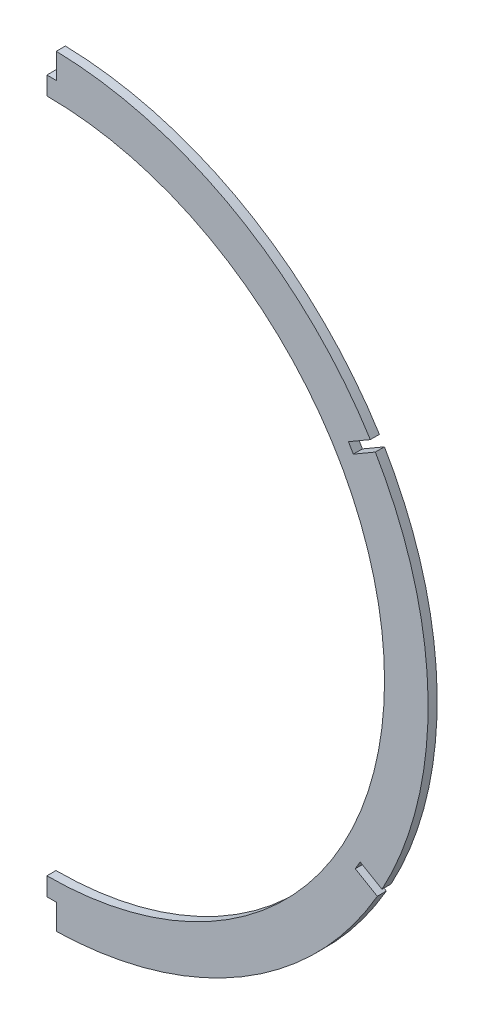
ISO-10303-21;
HEADER;
FILE_DESCRIPTION(('STEP AP214'),'2;1');
FILE_NAME('part.step','',(''),(''),'','','');
FILE_SCHEMA(('AUTOMOTIVE_DESIGN { 1 0 10303 214 1 1 1 1 }'));
ENDSEC;
DATA;
#1=APPLICATION_CONTEXT('core data for automotive mechanical design processes');
#2=APPLICATION_PROTOCOL_DEFINITION('international standard','automotive_design',2000,#1);
#3=PRODUCT_CONTEXT('',#1,'mechanical');
#4=PRODUCT('Part','Part','',(#3));
#5=PRODUCT_RELATED_PRODUCT_CATEGORY('part','',(#4));
#6=PRODUCT_DEFINITION_FORMATION('','',#4);
#7=PRODUCT_DEFINITION_CONTEXT('part definition',#1,'design');
#8=PRODUCT_DEFINITION('design','',#6,#7);
#9=PRODUCT_DEFINITION_SHAPE('','',#8);
#10=(LENGTH_UNIT() NAMED_UNIT(*) SI_UNIT(.MILLI.,.METRE.));
#11=(NAMED_UNIT(*) PLANE_ANGLE_UNIT() SI_UNIT($,.RADIAN.));
#12=(NAMED_UNIT(*) SI_UNIT($,.STERADIAN.) SOLID_ANGLE_UNIT());
#13=UNCERTAINTY_MEASURE_WITH_UNIT(LENGTH_MEASURE(1.E-05),#10,'distance_accuracy_value','');
#14=(GEOMETRIC_REPRESENTATION_CONTEXT(3) GLOBAL_UNCERTAINTY_ASSIGNED_CONTEXT((#13)) GLOBAL_UNIT_ASSIGNED_CONTEXT((#10,
#11,#12)) REPRESENTATION_CONTEXT('',''));
#15=CARTESIAN_POINT('',(0.,0.,0.));
#16=DIRECTION('',(0.,0.,1.));
#17=DIRECTION('',(1.,0.,0.));
#18=AXIS2_PLACEMENT_3D('',#15,#16,#17);
#19=CARTESIAN_POINT('',(0.,23.495,1.5875));
#20=DIRECTION('',(0.,0.,-1.));
#21=DIRECTION('',(-1.,0.,0.));
#22=AXIS2_PLACEMENT_3D('',#19,#20,#21);
#23=CYLINDRICAL_SURFACE('',#22,133.35);
#24=DIRECTION('',(0.,0.,-1.));
#25=VECTOR('',#24,1.);
#26=CARTESIAN_POINT('',(3.302,156.804111826611,1.58750000000002));
#27=LINE('',#26,#25);
#28=CARTESIAN_POINT('',(3.302,156.804111826611,1.58750000000002));
#29=VERTEX_POINT('',#28);
#30=CARTESIAN_POINT('',(3.302,156.804111826611,-1.5875));
#31=VERTEX_POINT('',#30);
#32=EDGE_CURVE('E179',#29,#31,#27,.T.);
#33=ORIENTED_EDGE('',*,*,#32,.F.);
#34=CARTESIAN_POINT('',(0.,23.495,1.5875));
#35=DIRECTION('',(0.,0.,1.));
#36=DIRECTION('',(1.,0.,0.));
#37=AXIS2_PLACEMENT_3D('',#34,#35,#36);
#38=CIRCLE('',#37,133.35);
#39=CARTESIAN_POINT('',(113.138876948253,94.0769879493919,1.58750000000002));
#40=VERTEX_POINT('',#39);
#41=EDGE_CURVE('E172',#40,#29,#38,.T.);
#42=ORIENTED_EDGE('',*,*,#41,.F.);
#43=DIRECTION('',(0.,0.,-1.));
#44=VECTOR('',#43,1.);
#45=CARTESIAN_POINT('',(113.138876948253,94.0769879493919,1.58750000000002));
#46=LINE('',#45,#44);
#47=CARTESIAN_POINT('',(113.138876948253,94.0769879493919,-1.5875));
#48=VERTEX_POINT('',#47);
#49=EDGE_CURVE('E200',#40,#48,#46,.T.);
#50=ORIENTED_EDGE('',*,*,#49,.T.);
#51=CARTESIAN_POINT('',(0.,23.495,-1.5875));
#52=DIRECTION('',(0.,0.,1.));
#53=DIRECTION('',(1.,0.,0.));
#54=AXIS2_PLACEMENT_3D('',#51,#52,#53);
#55=CIRCLE('',#54,133.35);
#56=EDGE_CURVE('E251',#48,#31,#55,.T.);
#57=ORIENTED_EDGE('',*,*,#56,.T.);
#58=EDGE_LOOP('',(#33,#42,#50,#57));
#59=FACE_BOUND('',#58,.T.);
#60=ADVANCED_FACE('F36',(#59),#23,.T.);
#61=DIRECTION('',(0.,0.,-1.));
#62=VECTOR('',#61,1.);
#63=CARTESIAN_POINT('',(114.89077453908,91.1879274430517,1.58750000000002));
#64=LINE('',#63,#62);
#65=CARTESIAN_POINT('',(114.89077453908,91.1879274430517,1.58750000000002));
#66=VERTEX_POINT('',#65);
#67=CARTESIAN_POINT('',(114.89077453908,91.1879274430517,-1.5875));
#68=VERTEX_POINT('',#67);
#69=EDGE_CURVE('E198',#66,#68,#64,.T.);
#70=ORIENTED_EDGE('',*,*,#69,.F.);
#71=CARTESIAN_POINT('',(117.216023462274,-40.0866509984727,1.58750000000002));
#72=VERTEX_POINT('',#71);
#73=EDGE_CURVE('E256',#72,#66,#38,.T.);
#74=ORIENTED_EDGE('',*,*,#73,.F.);
#75=DIRECTION('',(0.,0.,-1.));
#76=VECTOR('',#75,1.);
#77=CARTESIAN_POINT('',(117.216023462274,-40.0866509984727,1.58750000000002));
#78=LINE('',#77,#76);
#79=CARTESIAN_POINT('',(117.216023462274,-40.0866509984727,-1.5875));
#80=VERTEX_POINT('',#79);
#81=EDGE_CURVE('E221',#72,#80,#78,.T.);
#82=ORIENTED_EDGE('',*,*,#81,.T.);
#83=EDGE_CURVE('E260',#80,#68,#55,.T.);
#84=ORIENTED_EDGE('',*,*,#83,.T.);
#85=EDGE_LOOP('',(#70,#74,#82,#84));
#86=FACE_BOUND('',#85,.T.);
#87=ADVANCED_FACE('F275',(#86),#23,.T.);
#88=DIRECTION('',(0.,0.,-1.));
#89=VECTOR('',#88,1.);
#90=CARTESIAN_POINT('',(115.567539805184,-43.035941999774,1.58750000000002));
#91=LINE('',#90,#89);
#92=CARTESIAN_POINT('',(115.567539805184,-43.035941999774,1.58750000000002));
#93=VERTEX_POINT('',#92);
#94=CARTESIAN_POINT('',(115.567539805184,-43.035941999774,-1.5875));
#95=VERTEX_POINT('',#94);
#96=EDGE_CURVE('E193',#93,#95,#91,.T.);
#97=ORIENTED_EDGE('',*,*,#96,.F.);
#98=CARTESIAN_POINT('',(3.302,-109.814111826611,1.58750000000002));
#99=VERTEX_POINT('',#98);
#100=EDGE_CURVE('E258',#99,#93,#38,.T.);
#101=ORIENTED_EDGE('',*,*,#100,.F.);
#102=DIRECTION('',(0.,0.,-1.));
#103=VECTOR('',#102,1.);
#104=CARTESIAN_POINT('',(3.302,-109.814111826611,1.58750000000002));
#105=LINE('',#104,#103);
#106=CARTESIAN_POINT('',(3.302,-109.814111826611,-1.5875));
#107=VERTEX_POINT('',#106);
#108=EDGE_CURVE('E239',#99,#107,#105,.T.);
#109=ORIENTED_EDGE('',*,*,#108,.T.);
#110=EDGE_CURVE('E257',#107,#95,#55,.T.);
#111=ORIENTED_EDGE('',*,*,#110,.T.);
#112=EDGE_LOOP('',(#97,#101,#109,#111));
#113=FACE_BOUND('',#112,.T.);
#114=ADVANCED_FACE('F312',(#113),#23,.T.);
#115=CARTESIAN_POINT('',(0.,23.495,1.5875));
#116=DIRECTION('',(0.,0.,1.));
#117=DIRECTION('',(1.,0.,0.));
#118=AXIS2_PLACEMENT_3D('',#115,#116,#117);
#119=PLANE('',#118);
#120=ORIENTED_EDGE('',*,*,#41,.T.);
#121=DIRECTION('',(0.,1.,0.));
#122=VECTOR('',#121,1.);
#123=CARTESIAN_POINT('',(3.302,0.,1.58750000000002));
#124=LINE('',#123,#122);
#125=CARTESIAN_POINT('',(3.302,147.955,1.58750000000002));
#126=VERTEX_POINT('',#125);
#127=EDGE_CURVE('E152',#126,#29,#124,.T.);
#128=ORIENTED_EDGE('',*,*,#127,.F.);
#129=DIRECTION('',(-1.,0.,0.));
#130=VECTOR('',#129,1.);
#131=CARTESIAN_POINT('',(0.,147.955,1.58750000000002));
#132=LINE('',#131,#130);
#133=CARTESIAN_POINT('',(0.,147.955,1.58750000000002));
#134=VERTEX_POINT('',#133);
#135=EDGE_CURVE('E159',#126,#134,#132,.T.);
#136=ORIENTED_EDGE('',*,*,#135,.T.);
#137=DIRECTION('',(0.,1.,0.));
#138=VECTOR('',#137,1.);
#139=CARTESIAN_POINT('',(0.,23.495,1.5875));
#140=LINE('',#139,#138);
#141=CARTESIAN_POINT('',(0.,141.605,1.58750000000002));
#142=VERTEX_POINT('',#141);
#143=EDGE_CURVE('E247',#142,#134,#140,.T.);
#144=ORIENTED_EDGE('',*,*,#143,.F.);
#145=CARTESIAN_POINT('',(0.,23.495,1.5875));
#146=DIRECTION('',(0.,0.,1.));
#147=DIRECTION('',(1.,0.,0.));
#148=AXIS2_PLACEMENT_3D('',#145,#146,#147);
#149=CIRCLE('',#148,118.11);
#150=CARTESIAN_POINT('',(0.,-94.615,1.5875));
#151=VERTEX_POINT('',#150);
#152=EDGE_CURVE('E252',#151,#142,#149,.T.);
#153=ORIENTED_EDGE('',*,*,#152,.F.);
#154=CARTESIAN_POINT('',(0.,-100.965,1.5875));
#155=VERTEX_POINT('',#154);
#156=EDGE_CURVE('E244',#155,#151,#140,.T.);
#157=ORIENTED_EDGE('',*,*,#156,.F.);
#158=DIRECTION('',(-1.,0.,0.));
#159=VECTOR('',#158,1.);
#160=CARTESIAN_POINT('',(0.,-100.965,1.58750000000002));
#161=LINE('',#160,#159);
#162=CARTESIAN_POINT('',(3.302,-100.965,1.58750000000002));
#163=VERTEX_POINT('',#162);
#164=EDGE_CURVE('E227',#163,#155,#161,.T.);
#165=ORIENTED_EDGE('',*,*,#164,.F.);
#166=DIRECTION('',(0.,-1.,0.));
#167=VECTOR('',#166,1.);
#168=CARTESIAN_POINT('',(3.302,0.,1.58750000000002));
#169=LINE('',#168,#167);
#170=EDGE_CURVE('E229',#163,#99,#169,.T.);
#171=ORIENTED_EDGE('',*,*,#170,.T.);
#172=ORIENTED_EDGE('',*,*,#100,.T.);
#173=DIRECTION('',(0.864121649398804,-0.503282996971178,0.));
#174=VECTOR('',#173,1.);
#175=CARTESIAN_POINT('',(10.5563047964807,18.1248553342521,1.58750000000002));
#176=LINE('',#175,#174);
#177=CARTESIAN_POINT('',(107.866561664445,-38.5507270292004,1.58750000000002));
#178=VERTEX_POINT('',#177);
#179=EDGE_CURVE('E204',#178,#93,#176,.T.);
#180=ORIENTED_EDGE('',*,*,#179,.F.);
#181=DIRECTION('',(0.503282996971166,0.864121649398811,0.));
#182=VECTOR('',#181,1.);
#183=CARTESIAN_POINT('',(97.3102568679656,-56.6755823634513,1.58750000000002));
#184=LINE('',#183,#182);
#185=CARTESIAN_POINT('',(109.566752284813,-35.6315512732013,1.58750000000002));
#186=VERTEX_POINT('',#185);
#187=EDGE_CURVE('E206',#178,#186,#184,.T.);
#188=ORIENTED_EDGE('',*,*,#187,.T.);
#189=DIRECTION('',(0.86412164939881,-0.503282996971168,0.));
#190=VECTOR('',#189,1.);
#191=CARTESIAN_POINT('',(12.2564954168479,21.0440310902502,1.58750000000002));
#192=LINE('',#191,#190);
#193=EDGE_CURVE('E210',#186,#72,#192,.T.);
#194=ORIENTED_EDGE('',*,*,#193,.T.);
#195=ORIENTED_EDGE('',*,*,#73,.T.);
#196=DIRECTION('',(0.864121648134546,0.503282999141871,0.));
#197=VECTOR('',#196,1.);
#198=CARTESIAN_POINT('',(-10.5563048253218,18.1248552790799,1.58750000000002));
#199=LINE('',#198,#197);
#200=CARTESIAN_POINT('',(107.189796409653,86.7027124531591,1.58750000000002));
#201=VERTEX_POINT('',#200);
#202=EDGE_CURVE('E188',#201,#66,#199,.T.);
#203=ORIENTED_EDGE('',*,*,#202,.F.);
#204=DIRECTION('',(0.503282999141861,-0.864121648134551,0.));
#205=VECTOR('',#204,1.);
#206=CARTESIAN_POINT('',(117.746101234976,68.5778571740777,1.58750000000002));
#207=LINE('',#206,#205);
#208=CARTESIAN_POINT('',(105.489605781952,89.6218882048873,1.58750000000002));
#209=VERTEX_POINT('',#208);
#210=EDGE_CURVE('E183',#209,#201,#207,.T.);
#211=ORIENTED_EDGE('',*,*,#210,.F.);
#212=DIRECTION('',(0.864121648134546,0.503282999141871,0.));
#213=VECTOR('',#212,1.);
#214=CARTESIAN_POINT('',(-12.2564954530229,21.0440310308081,1.58750000000002));
#215=LINE('',#214,#213);
#216=EDGE_CURVE('E185',#209,#40,#215,.T.);
#217=ORIENTED_EDGE('',*,*,#216,.T.);
#218=EDGE_LOOP('',(#120,#128,#136,#144,#153,#157,#165,#171,#172,#180,#188,#194,#195,#203,#211,#217));
#219=FACE_BOUND('',#218,.T.);
#220=ADVANCED_FACE('F169',(#219),#119,.T.);
#221=CARTESIAN_POINT('',(0.,23.495,-1.5875));
#222=DIRECTION('',(0.,0.,1.));
#223=DIRECTION('',(1.,0.,0.));
#224=AXIS2_PLACEMENT_3D('',#221,#222,#223);
#225=PLANE('',#224);
#226=DIRECTION('',(0.,1.,0.));
#227=VECTOR('',#226,1.);
#228=CARTESIAN_POINT('',(3.302,0.,-1.5875));
#229=LINE('',#228,#227);
#230=CARTESIAN_POINT('',(3.302,147.955,-1.5875));
#231=VERTEX_POINT('',#230);
#232=EDGE_CURVE('E155',#231,#31,#229,.T.);
#233=ORIENTED_EDGE('',*,*,#232,.T.);
#234=ORIENTED_EDGE('',*,*,#56,.F.);
#235=DIRECTION('',(0.864121648134546,0.503282999141871,0.));
#236=VECTOR('',#235,1.);
#237=CARTESIAN_POINT('',(-12.2564954530229,21.0440310308081,-1.5875));
#238=LINE('',#237,#236);
#239=CARTESIAN_POINT('',(105.489605781952,89.6218882048873,-1.5875));
#240=VERTEX_POINT('',#239);
#241=EDGE_CURVE('E192',#240,#48,#238,.T.);
#242=ORIENTED_EDGE('',*,*,#241,.F.);
#243=DIRECTION('',(0.503282999141861,-0.864121648134551,0.));
#244=VECTOR('',#243,1.);
#245=CARTESIAN_POINT('',(117.746101234976,68.5778571740777,-1.5875));
#246=LINE('',#245,#244);
#247=CARTESIAN_POINT('',(107.189796409653,86.7027124531591,-1.5875));
#248=VERTEX_POINT('',#247);
#249=EDGE_CURVE('E50',#240,#248,#246,.T.);
#250=ORIENTED_EDGE('',*,*,#249,.T.);
#251=DIRECTION('',(0.864121648134546,0.503282999141871,0.));
#252=VECTOR('',#251,1.);
#253=CARTESIAN_POINT('',(-10.5563048253218,18.1248552790799,-1.5875));
#254=LINE('',#253,#252);
#255=EDGE_CURVE('E186',#248,#68,#254,.T.);
#256=ORIENTED_EDGE('',*,*,#255,.T.);
#257=ORIENTED_EDGE('',*,*,#83,.F.);
#258=DIRECTION('',(0.86412164939881,-0.503282996971168,0.));
#259=VECTOR('',#258,1.);
#260=CARTESIAN_POINT('',(12.2564954168479,21.0440310902502,-1.5875));
#261=LINE('',#260,#259);
#262=CARTESIAN_POINT('',(109.566752284813,-35.6315512732013,-1.5875));
#263=VERTEX_POINT('',#262);
#264=EDGE_CURVE('E207',#263,#80,#261,.T.);
#265=ORIENTED_EDGE('',*,*,#264,.F.);
#266=DIRECTION('',(0.503282996971166,0.864121649398811,0.));
#267=VECTOR('',#266,1.);
#268=CARTESIAN_POINT('',(97.3102568679656,-56.6755823634513,-1.5875));
#269=LINE('',#268,#267);
#270=CARTESIAN_POINT('',(107.866561664445,-38.5507270292004,-1.5875));
#271=VERTEX_POINT('',#270);
#272=EDGE_CURVE('E215',#271,#263,#269,.T.);
#273=ORIENTED_EDGE('',*,*,#272,.F.);
#274=DIRECTION('',(0.864121649398804,-0.503282996971178,0.));
#275=VECTOR('',#274,1.);
#276=CARTESIAN_POINT('',(10.5563047964807,18.1248553342521,-1.5875));
#277=LINE('',#276,#275);
#278=EDGE_CURVE('E58',#271,#95,#277,.T.);
#279=ORIENTED_EDGE('',*,*,#278,.T.);
#280=ORIENTED_EDGE('',*,*,#110,.F.);
#281=DIRECTION('',(0.,-1.,0.));
#282=VECTOR('',#281,1.);
#283=CARTESIAN_POINT('',(3.302,0.,-1.5875));
#284=LINE('',#283,#282);
#285=CARTESIAN_POINT('',(3.302,-100.965,-1.5875));
#286=VERTEX_POINT('',#285);
#287=EDGE_CURVE('E230',#286,#107,#284,.T.);
#288=ORIENTED_EDGE('',*,*,#287,.F.);
#289=DIRECTION('',(-1.,0.,0.));
#290=VECTOR('',#289,1.);
#291=CARTESIAN_POINT('',(0.,-100.965,-1.5875));
#292=LINE('',#291,#290);
#293=CARTESIAN_POINT('',(0.,-100.965,-1.5875));
#294=VERTEX_POINT('',#293);
#295=EDGE_CURVE('E234',#286,#294,#292,.T.);
#296=ORIENTED_EDGE('',*,*,#295,.T.);
#297=DIRECTION('',(0.,1.,0.));
#298=VECTOR('',#297,1.);
#299=CARTESIAN_POINT('',(0.,23.495,-1.5875));
#300=LINE('',#299,#298);
#301=CARTESIAN_POINT('',(0.,-94.615,-1.58750000000002));
#302=VERTEX_POINT('',#301);
#303=EDGE_CURVE('E181',#294,#302,#300,.T.);
#304=ORIENTED_EDGE('',*,*,#303,.T.);
#305=CARTESIAN_POINT('',(0.,23.495,-1.58750000000002));
#306=DIRECTION('',(0.,0.,1.));
#307=DIRECTION('',(1.,0.,0.));
#308=AXIS2_PLACEMENT_3D('',#305,#306,#307);
#309=CIRCLE('',#308,118.11);
#310=CARTESIAN_POINT('',(0.,141.605,-1.58750000000002));
#311=VERTEX_POINT('',#310);
#312=EDGE_CURVE('E248',#311,#302,#309,.F.);
#313=ORIENTED_EDGE('',*,*,#312,.F.);
#314=CARTESIAN_POINT('',(0.,147.955,-1.5875));
#315=VERTEX_POINT('',#314);
#316=EDGE_CURVE('E245',#311,#315,#300,.T.);
#317=ORIENTED_EDGE('',*,*,#316,.T.);
#318=DIRECTION('',(-1.,0.,0.));
#319=VECTOR('',#318,1.);
#320=CARTESIAN_POINT('',(0.,147.955,-1.5875));
#321=LINE('',#320,#319);
#322=EDGE_CURVE('E173',#231,#315,#321,.T.);
#323=ORIENTED_EDGE('',*,*,#322,.F.);
#324=EDGE_LOOP('',(#233,#234,#242,#250,#256,#257,#265,#273,#279,#280,#288,#296,#304,#313,#317,#323));
#325=FACE_BOUND('',#324,.T.);
#326=ADVANCED_FACE('F282',(#325),#225,.F.);
#327=CARTESIAN_POINT('',(0.,0.,0.));
#328=DIRECTION('',(1.,0.,0.));
#329=DIRECTION('',(0.,0.,-1.));
#330=AXIS2_PLACEMENT_3D('',#327,#328,#329);
#331=PLANE('',#330);
#332=DIRECTION('',(0.,0.,-1.));
#333=VECTOR('',#332,1.);
#334=CARTESIAN_POINT('',(0.,-100.965,1.58750000000002));
#335=LINE('',#334,#333);
#336=EDGE_CURVE('E216',#155,#294,#335,.T.);
#337=ORIENTED_EDGE('',*,*,#336,.F.);
#338=ORIENTED_EDGE('',*,*,#156,.T.);
#339=DIRECTION('',(0.,0.,1.));
#340=VECTOR('',#339,1.);
#341=CARTESIAN_POINT('',(0.,-94.615,-335.653027703772));
#342=LINE('',#341,#340);
#343=EDGE_CURVE('E43',#302,#151,#342,.T.);
#344=ORIENTED_EDGE('',*,*,#343,.F.);
#345=ORIENTED_EDGE('',*,*,#303,.F.);
#346=EDGE_LOOP('',(#337,#338,#344,#345));
#347=FACE_BOUND('',#346,.T.);
#348=ADVANCED_FACE('F301',(#347),#331,.F.);
#349=CARTESIAN_POINT('',(0.,23.495,-335.653027703772));
#350=DIRECTION('',(0.,0.,1.));
#351=DIRECTION('',(1.,0.,0.));
#352=AXIS2_PLACEMENT_3D('',#349,#350,#351);
#353=CYLINDRICAL_SURFACE('',#352,118.11);
#354=ORIENTED_EDGE('',*,*,#152,.T.);
#355=DIRECTION('',(0.,0.,1.));
#356=VECTOR('',#355,1.);
#357=CARTESIAN_POINT('',(0.,141.605,-335.653027703772));
#358=LINE('',#357,#356);
#359=EDGE_CURVE('E11',#142,#311,#358,.F.);
#360=ORIENTED_EDGE('',*,*,#359,.T.);
#361=ORIENTED_EDGE('',*,*,#312,.T.);
#362=ORIENTED_EDGE('',*,*,#343,.T.);
#363=EDGE_LOOP('',(#354,#360,#361,#362));
#364=FACE_BOUND('',#363,.T.);
#365=ADVANCED_FACE('F295',(#364),#353,.F.);
#366=ORIENTED_EDGE('',*,*,#143,.T.);
#367=DIRECTION('',(0.,0.,-1.));
#368=VECTOR('',#367,1.);
#369=CARTESIAN_POINT('',(0.,147.955,1.58750000000002));
#370=LINE('',#369,#368);
#371=EDGE_CURVE('E158',#134,#315,#370,.T.);
#372=ORIENTED_EDGE('',*,*,#371,.T.);
#373=ORIENTED_EDGE('',*,*,#316,.F.);
#374=ORIENTED_EDGE('',*,*,#359,.F.);
#375=EDGE_LOOP('',(#366,#372,#373,#374));
#376=FACE_BOUND('',#375,.T.);
#377=ADVANCED_FACE('F293',(#376),#331,.F.);
#378=CARTESIAN_POINT('',(3.302,0.,1.58750000000002));
#379=DIRECTION('',(-1.,0.,0.));
#380=DIRECTION('',(0.,0.,1.));
#381=AXIS2_PLACEMENT_3D('',#378,#379,#380);
#382=PLANE('',#381);
#383=ORIENTED_EDGE('',*,*,#232,.F.);
#384=DIRECTION('',(0.,0.,-1.));
#385=VECTOR('',#384,1.);
#386=CARTESIAN_POINT('',(3.302,147.955,1.58750000000002));
#387=LINE('',#386,#385);
#388=EDGE_CURVE('E148',#126,#231,#387,.T.);
#389=ORIENTED_EDGE('',*,*,#388,.F.);
#390=ORIENTED_EDGE('',*,*,#127,.T.);
#391=ORIENTED_EDGE('',*,*,#32,.T.);
#392=EDGE_LOOP('',(#383,#389,#390,#391));
#393=FACE_BOUND('',#392,.T.);
#394=ADVANCED_FACE('F150',(#393),#382,.T.);
#395=CARTESIAN_POINT('',(0.,147.955,1.58750000000002));
#396=DIRECTION('',(0.,-1.,0.));
#397=DIRECTION('',(0.,0.,-1.));
#398=AXIS2_PLACEMENT_3D('',#395,#396,#397);
#399=PLANE('',#398);
#400=ORIENTED_EDGE('',*,*,#322,.T.);
#401=ORIENTED_EDGE('',*,*,#371,.F.);
#402=ORIENTED_EDGE('',*,*,#135,.F.);
#403=ORIENTED_EDGE('',*,*,#388,.T.);
#404=EDGE_LOOP('',(#400,#401,#402,#403));
#405=FACE_BOUND('',#404,.T.);
#406=ADVANCED_FACE('F162',(#405),#399,.F.);
#407=CARTESIAN_POINT('',(0.,-100.965,1.58750000000002));
#408=DIRECTION('',(0.,-1.,0.));
#409=DIRECTION('',(0.,0.,-1.));
#410=AXIS2_PLACEMENT_3D('',#407,#408,#409);
#411=PLANE('',#410);
#412=ORIENTED_EDGE('',*,*,#295,.F.);
#413=DIRECTION('',(0.,0.,-1.));
#414=VECTOR('',#413,1.);
#415=CARTESIAN_POINT('',(3.302,-100.965,1.58750000000002));
#416=LINE('',#415,#414);
#417=EDGE_CURVE('E233',#163,#286,#416,.T.);
#418=ORIENTED_EDGE('',*,*,#417,.F.);
#419=ORIENTED_EDGE('',*,*,#164,.T.);
#420=ORIENTED_EDGE('',*,*,#336,.T.);
#421=EDGE_LOOP('',(#412,#418,#419,#420));
#422=FACE_BOUND('',#421,.T.);
#423=ADVANCED_FACE('F305',(#422),#411,.T.);
#424=CARTESIAN_POINT('',(3.302,0.,1.58750000000002));
#425=DIRECTION('',(1.,0.,0.));
#426=DIRECTION('',(0.,0.,-1.));
#427=AXIS2_PLACEMENT_3D('',#424,#425,#426);
#428=PLANE('',#427);
#429=ORIENTED_EDGE('',*,*,#287,.T.);
#430=ORIENTED_EDGE('',*,*,#108,.F.);
#431=ORIENTED_EDGE('',*,*,#170,.F.);
#432=ORIENTED_EDGE('',*,*,#417,.T.);
#433=EDGE_LOOP('',(#429,#430,#431,#432));
#434=FACE_BOUND('',#433,.T.);
#435=ADVANCED_FACE('F307',(#434),#428,.F.);
#436=CARTESIAN_POINT('',(10.5563047964807,18.1248553342521,1.58750000000002));
#437=DIRECTION('',(0.503282996971178,0.864121649398804,0.));
#438=DIRECTION('',(-0.864121649398804,0.503282996971178,0.));
#439=AXIS2_PLACEMENT_3D('',#436,#437,#438);
#440=PLANE('',#439);
#441=ORIENTED_EDGE('',*,*,#278,.F.);
#442=DIRECTION('',(0.,0.,-1.));
#443=VECTOR('',#442,1.);
#444=CARTESIAN_POINT('',(107.866561664445,-38.5507270292004,1.58750000000002));
#445=LINE('',#444,#443);
#446=EDGE_CURVE('E213',#178,#271,#445,.T.);
#447=ORIENTED_EDGE('',*,*,#446,.F.);
#448=ORIENTED_EDGE('',*,*,#179,.T.);
#449=ORIENTED_EDGE('',*,*,#96,.T.);
#450=EDGE_LOOP('',(#441,#447,#448,#449));
#451=FACE_BOUND('',#450,.T.);
#452=ADVANCED_FACE('F317',(#451),#440,.T.);
#453=CARTESIAN_POINT('',(12.2564954168479,21.0440310902502,1.58750000000002));
#454=DIRECTION('',(0.503282996971168,0.86412164939881,0.));
#455=DIRECTION('',(-0.86412164939881,0.503282996971168,0.));
#456=AXIS2_PLACEMENT_3D('',#453,#454,#455);
#457=PLANE('',#456);
#458=ORIENTED_EDGE('',*,*,#264,.T.);
#459=ORIENTED_EDGE('',*,*,#81,.F.);
#460=ORIENTED_EDGE('',*,*,#193,.F.);
#461=DIRECTION('',(0.,0.,-1.));
#462=VECTOR('',#461,1.);
#463=CARTESIAN_POINT('',(109.566752284813,-35.6315512732013,1.58750000000002));
#464=LINE('',#463,#462);
#465=EDGE_CURVE('E224',#186,#263,#464,.T.);
#466=ORIENTED_EDGE('',*,*,#465,.T.);
#467=EDGE_LOOP('',(#458,#459,#460,#466));
#468=FACE_BOUND('',#467,.T.);
#469=ADVANCED_FACE('F319',(#468),#457,.F.);
#470=CARTESIAN_POINT('',(97.3102568679656,-56.6755823634513,1.58750000000002));
#471=DIRECTION('',(-0.864121649398811,0.503282996971166,0.));
#472=DIRECTION('',(-0.503282996971166,-0.864121649398811,0.));
#473=AXIS2_PLACEMENT_3D('',#470,#471,#472);
#474=PLANE('',#473);
#475=ORIENTED_EDGE('',*,*,#272,.T.);
#476=ORIENTED_EDGE('',*,*,#465,.F.);
#477=ORIENTED_EDGE('',*,*,#187,.F.);
#478=ORIENTED_EDGE('',*,*,#446,.T.);
#479=EDGE_LOOP('',(#475,#476,#477,#478));
#480=FACE_BOUND('',#479,.T.);
#481=ADVANCED_FACE('F315',(#480),#474,.F.);
#482=CARTESIAN_POINT('',(117.746101234976,68.5778571740777,1.58750000000002));
#483=DIRECTION('',(0.864121648134551,0.503282999141861,0.));
#484=DIRECTION('',(-0.503282999141861,0.864121648134551,0.));
#485=AXIS2_PLACEMENT_3D('',#482,#483,#484);
#486=PLANE('',#485);
#487=ORIENTED_EDGE('',*,*,#249,.F.);
#488=DIRECTION('',(0.,0.,-1.));
#489=VECTOR('',#488,1.);
#490=CARTESIAN_POINT('',(105.489605781952,89.6218882048873,1.58750000000002));
#491=LINE('',#490,#489);
#492=EDGE_CURVE('E190',#209,#240,#491,.T.);
#493=ORIENTED_EDGE('',*,*,#492,.F.);
#494=ORIENTED_EDGE('',*,*,#210,.T.);
#495=DIRECTION('',(0.,0.,-1.));
#496=VECTOR('',#495,1.);
#497=CARTESIAN_POINT('',(107.189796409653,86.7027124531591,1.58750000000002));
#498=LINE('',#497,#496);
#499=EDGE_CURVE('E177',#201,#248,#498,.T.);
#500=ORIENTED_EDGE('',*,*,#499,.T.);
#501=EDGE_LOOP('',(#487,#493,#494,#500));
#502=FACE_BOUND('',#501,.T.);
#503=ADVANCED_FACE('F358',(#502),#486,.T.);
#504=CARTESIAN_POINT('',(-10.5563048253218,18.1248552790799,1.58750000000002));
#505=DIRECTION('',(-0.503282999141871,0.864121648134546,0.));
#506=DIRECTION('',(-0.864121648134546,-0.503282999141871,0.));
#507=AXIS2_PLACEMENT_3D('',#504,#505,#506);
#508=PLANE('',#507);
#509=ORIENTED_EDGE('',*,*,#255,.F.);
#510=ORIENTED_EDGE('',*,*,#499,.F.);
#511=ORIENTED_EDGE('',*,*,#202,.T.);
#512=ORIENTED_EDGE('',*,*,#69,.T.);
#513=EDGE_LOOP('',(#509,#510,#511,#512));
#514=FACE_BOUND('',#513,.T.);
#515=ADVANCED_FACE('F279',(#514),#508,.T.);
#516=CARTESIAN_POINT('',(-12.2564954530229,21.0440310308081,1.58750000000002));
#517=DIRECTION('',(-0.503282999141871,0.864121648134546,0.));
#518=DIRECTION('',(-0.864121648134546,-0.503282999141871,0.));
#519=AXIS2_PLACEMENT_3D('',#516,#517,#518);
#520=PLANE('',#519);
#521=ORIENTED_EDGE('',*,*,#241,.T.);
#522=ORIENTED_EDGE('',*,*,#49,.F.);
#523=ORIENTED_EDGE('',*,*,#216,.F.);
#524=ORIENTED_EDGE('',*,*,#492,.T.);
#525=EDGE_LOOP('',(#521,#522,#523,#524));
#526=FACE_BOUND('',#525,.T.);
#527=ADVANCED_FACE('F287',(#526),#520,.F.);
#528=CLOSED_SHELL('',(#60,#87,#114,#220,#326,#348,#365,#377,#394,#406,#423,#435,#452,#469,#481,
#503,#515,#527));
#529=MANIFOLD_SOLID_BREP('B2',#528);
#530=ADVANCED_BREP_SHAPE_REPRESENTATION('',(#18,#529),#14);
#531=SHAPE_DEFINITION_REPRESENTATION(#9,#530);
ENDSEC;
END-ISO-10303-21;
